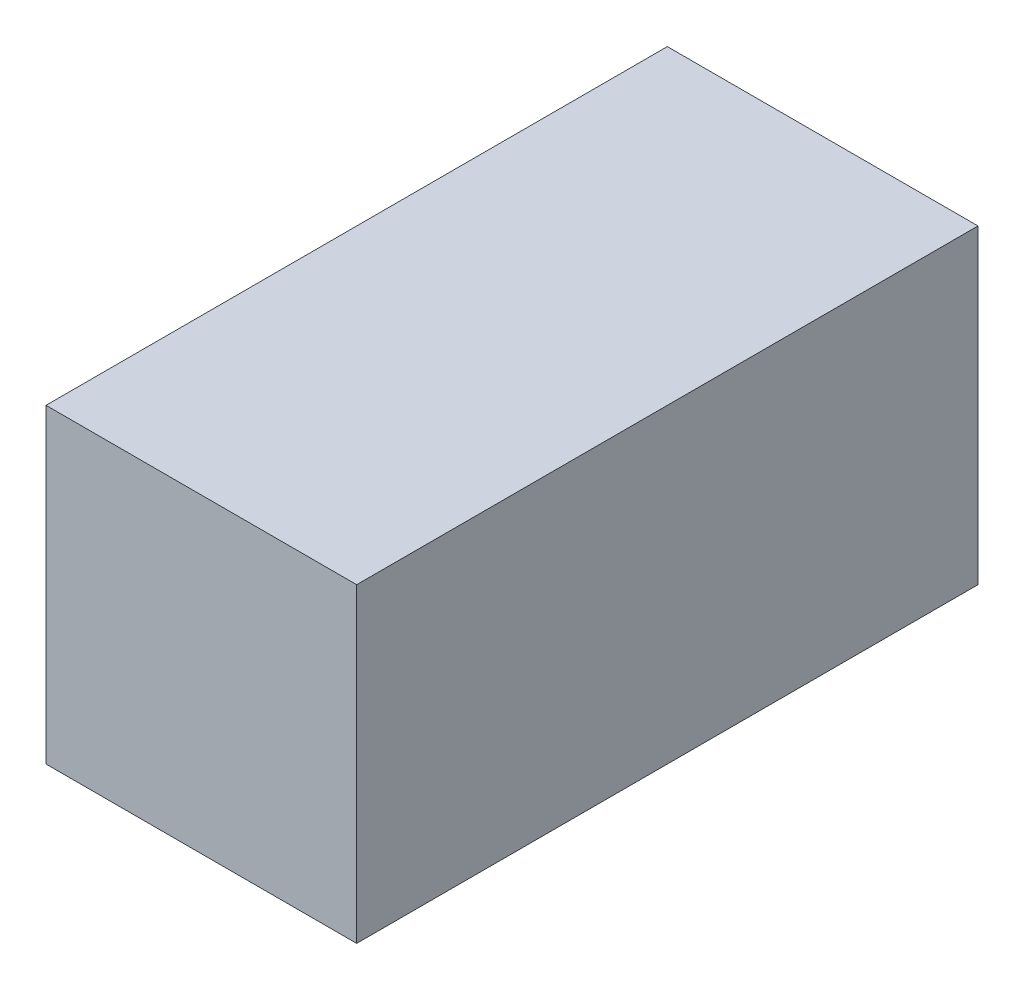
ISO-10303-21;
HEADER;
FILE_DESCRIPTION(('STEP AP214'),'2;1');
FILE_NAME('part.step','',(''),(''),'','','');
FILE_SCHEMA(('AUTOMOTIVE_DESIGN { 1 0 10303 214 1 1 1 1 }'));
ENDSEC;
DATA;
#1=APPLICATION_CONTEXT('core data for automotive mechanical design processes');
#2=APPLICATION_PROTOCOL_DEFINITION('international standard','automotive_design',2000,#1);
#3=PRODUCT_CONTEXT('',#1,'mechanical');
#4=PRODUCT('Part','Part','',(#3));
#5=PRODUCT_RELATED_PRODUCT_CATEGORY('part','',(#4));
#6=PRODUCT_DEFINITION_FORMATION('','',#4);
#7=PRODUCT_DEFINITION_CONTEXT('part definition',#1,'design');
#8=PRODUCT_DEFINITION('design','',#6,#7);
#9=PRODUCT_DEFINITION_SHAPE('','',#8);
#10=(LENGTH_UNIT() NAMED_UNIT(*) SI_UNIT(.MILLI.,.METRE.));
#11=(NAMED_UNIT(*) PLANE_ANGLE_UNIT() SI_UNIT($,.RADIAN.));
#12=(NAMED_UNIT(*) SI_UNIT($,.STERADIAN.) SOLID_ANGLE_UNIT());
#13=UNCERTAINTY_MEASURE_WITH_UNIT(LENGTH_MEASURE(1.E-05),#10,'distance_accuracy_value','');
#14=(GEOMETRIC_REPRESENTATION_CONTEXT(3) GLOBAL_UNCERTAINTY_ASSIGNED_CONTEXT((#13)) GLOBAL_UNIT_ASSIGNED_CONTEXT((#10,
#11,#12)) REPRESENTATION_CONTEXT('',''));
#15=CARTESIAN_POINT('',(0.,0.,0.));
#16=DIRECTION('',(0.,0.,1.));
#17=DIRECTION('',(1.,0.,0.));
#18=AXIS2_PLACEMENT_3D('',#15,#16,#17);
#19=CARTESIAN_POINT('',(-0.126999999999836,0.253999999999949,0.254000000000004));
#20=DIRECTION('',(1.,0.,0.));
#21=DIRECTION('',(0.,1.,0.));
#22=AXIS2_PLACEMENT_3D('',#19,#20,#21);
#23=PLANE('',#22);
#24=DIRECTION('',(0.,-1.,0.));
#25=VECTOR('',#24,1.);
#26=CARTESIAN_POINT('',(-0.126999999999836,0.253999999999949,-0.253999999999949));
#27=LINE('',#26,#25);
#28=CARTESIAN_POINT('',(-0.126999999999836,0.253999999999949,-0.253999999999949));
#29=VERTEX_POINT('',#28);
#30=CARTESIAN_POINT('',(-0.126999999999787,0.,-0.253999999999949));
#31=VERTEX_POINT('',#30);
#32=EDGE_CURVE('E97',#29,#31,#27,.T.);
#33=ORIENTED_EDGE('',*,*,#32,.T.);
#34=DIRECTION('',(0.,0.,-0.999999999999933));
#35=VECTOR('',#34,1.);
#36=CARTESIAN_POINT('',(-0.126999999999761,0.,0.254000000000004));
#37=LINE('',#36,#35);
#38=CARTESIAN_POINT('',(-0.126999999999761,0.,0.254000000000004));
#39=VERTEX_POINT('',#38);
#40=EDGE_CURVE('E11',#39,#31,#37,.T.);
#41=ORIENTED_EDGE('',*,*,#40,.F.);
#42=DIRECTION('',(0.,-1.,0.));
#43=VECTOR('',#42,1.);
#44=CARTESIAN_POINT('',(-0.126999999999836,0.253999999999949,0.254000000000004));
#45=LINE('',#44,#43);
#46=CARTESIAN_POINT('',(-0.126999999999836,0.253999999999949,0.254000000000004));
#47=VERTEX_POINT('',#46);
#48=EDGE_CURVE('E85',#47,#39,#45,.T.);
#49=ORIENTED_EDGE('',*,*,#48,.F.);
#50=DIRECTION('',(0.,0.,-0.999999999999933));
#51=VECTOR('',#50,1.);
#52=CARTESIAN_POINT('',(-0.126999999999836,0.253999999999949,0.254000000000004));
#53=LINE('',#52,#51);
#54=EDGE_CURVE('E93',#47,#29,#53,.T.);
#55=ORIENTED_EDGE('',*,*,#54,.T.);
#56=EDGE_LOOP('',(#33,#41,#49,#55));
#57=FACE_BOUND('',#56,.T.);
#58=ADVANCED_FACE('F34',(#57),#23,.F.);
#59=CARTESIAN_POINT('',(-0.126999999999761,0.,0.254000000000004));
#60=DIRECTION('',(0.,1.00000000000001,0.));
#61=DIRECTION('',(0.,0.,0.999999999999933));
#62=AXIS2_PLACEMENT_3D('',#59,#60,#61);
#63=PLANE('',#62);
#64=DIRECTION('',(1.00000000000001,0.,0.));
#65=VECTOR('',#64,1.);
#66=CARTESIAN_POINT('',(-0.126999999999787,0.,-0.253999999999949));
#67=LINE('',#66,#65);
#68=CARTESIAN_POINT('',(0.127000000000151,0.,-0.253999999999865));
#69=VERTEX_POINT('',#68);
#70=EDGE_CURVE('E89',#31,#69,#67,.T.);
#71=ORIENTED_EDGE('',*,*,#70,.T.);
#72=DIRECTION('',(0.,0.,-0.999999999999933));
#73=VECTOR('',#72,1.);
#74=CARTESIAN_POINT('',(0.12700000000008,0.,0.254000000000004));
#75=LINE('',#74,#73);
#76=CARTESIAN_POINT('',(0.12700000000008,0.,0.254000000000004));
#77=VERTEX_POINT('',#76);
#78=EDGE_CURVE('E42',#77,#69,#75,.T.);
#79=ORIENTED_EDGE('',*,*,#78,.F.);
#80=DIRECTION('',(1.00000000000001,0.,0.));
#81=VECTOR('',#80,1.);
#82=CARTESIAN_POINT('',(-0.126999999999761,0.,0.254000000000004));
#83=LINE('',#82,#81);
#84=EDGE_CURVE('E80',#39,#77,#83,.T.);
#85=ORIENTED_EDGE('',*,*,#84,.F.);
#86=ORIENTED_EDGE('',*,*,#40,.T.);
#87=EDGE_LOOP('',(#71,#79,#85,#86));
#88=FACE_BOUND('',#87,.T.);
#89=ADVANCED_FACE('F88',(#88),#63,.F.);
#90=CARTESIAN_POINT('',(0.127000000000061,0.253999999999935,0.254000000000004));
#91=DIRECTION('',(-1.00000000000001,0.,0.));
#92=DIRECTION('',(0.,-1.00000000000001,0.));
#93=AXIS2_PLACEMENT_3D('',#90,#91,#92);
#94=PLANE('',#93);
#95=DIRECTION('',(0.,1.00000000000001,0.));
#96=VECTOR('',#95,1.);
#97=CARTESIAN_POINT('',(0.127000000000214,0.253999999999976,-0.253999999999865));
#98=LINE('',#97,#96);
#99=CARTESIAN_POINT('',(0.127000000000214,0.253999999999976,-0.253999999999865));
#100=VERTEX_POINT('',#99);
#101=EDGE_CURVE('E67',#69,#100,#98,.T.);
#102=ORIENTED_EDGE('',*,*,#101,.T.);
#103=DIRECTION('',(0.,0.,-0.999999999999933));
#104=VECTOR('',#103,1.);
#105=CARTESIAN_POINT('',(0.127000000000061,0.253999999999935,0.254000000000004));
#106=LINE('',#105,#104);
#107=CARTESIAN_POINT('',(0.127000000000061,0.253999999999935,0.254000000000004));
#108=VERTEX_POINT('',#107);
#109=EDGE_CURVE('E90',#108,#100,#106,.T.);
#110=ORIENTED_EDGE('',*,*,#109,.F.);
#111=DIRECTION('',(0.,1.00000000000001,0.));
#112=VECTOR('',#111,1.);
#113=CARTESIAN_POINT('',(0.127000000000061,0.253999999999935,0.254000000000004));
#114=LINE('',#113,#112);
#115=EDGE_CURVE('E83',#77,#108,#114,.T.);
#116=ORIENTED_EDGE('',*,*,#115,.F.);
#117=ORIENTED_EDGE('',*,*,#78,.T.);
#118=EDGE_LOOP('',(#102,#110,#116,#117));
#119=FACE_BOUND('',#118,.T.);
#120=ADVANCED_FACE('F91',(#119),#94,.F.);
#121=CARTESIAN_POINT('',(-0.126999999999836,0.253999999999949,0.254000000000004));
#122=DIRECTION('',(0.,-1.00000000000001,0.));
#123=DIRECTION('',(0.,0.,-0.999999999999933));
#124=AXIS2_PLACEMENT_3D('',#121,#122,#123);
#125=PLANE('',#124);
#126=DIRECTION('',(-1.00000000000001,0.,0.));
#127=VECTOR('',#126,1.);
#128=CARTESIAN_POINT('',(-0.126999999999836,0.253999999999949,-0.253999999999949));
#129=LINE('',#128,#127);
#130=EDGE_CURVE('E73',#100,#29,#129,.T.);
#131=ORIENTED_EDGE('',*,*,#130,.T.);
#132=ORIENTED_EDGE('',*,*,#54,.F.);
#133=DIRECTION('',(-1.00000000000001,0.,0.));
#134=VECTOR('',#133,1.);
#135=CARTESIAN_POINT('',(-0.126999999999836,0.253999999999949,0.254000000000004));
#136=LINE('',#135,#134);
#137=EDGE_CURVE('E50',#108,#47,#136,.T.);
#138=ORIENTED_EDGE('',*,*,#137,.F.);
#139=ORIENTED_EDGE('',*,*,#109,.T.);
#140=EDGE_LOOP('',(#131,#132,#138,#139));
#141=FACE_BOUND('',#140,.T.);
#142=ADVANCED_FACE('F104',(#141),#125,.F.);
#143=CARTESIAN_POINT('',(-0.126999999999761,0.,0.254000000000004));
#144=DIRECTION('',(0.,0.,0.999999999999933));
#145=DIRECTION('',(1.00000000000001,0.,0.));
#146=AXIS2_PLACEMENT_3D('',#143,#144,#145);
#147=PLANE('',#146);
#148=ORIENTED_EDGE('',*,*,#48,.T.);
#149=ORIENTED_EDGE('',*,*,#84,.T.);
#150=ORIENTED_EDGE('',*,*,#115,.T.);
#151=ORIENTED_EDGE('',*,*,#137,.T.);
#152=EDGE_LOOP('',(#148,#149,#150,#151));
#153=FACE_BOUND('',#152,.T.);
#154=ADVANCED_FACE('F81',(#153),#147,.T.);
#155=CARTESIAN_POINT('',(-0.126999999999787,0.,-0.253999999999949));
#156=DIRECTION('',(0.,0.,0.999999999999933));
#157=DIRECTION('',(1.00000000000001,0.,0.));
#158=AXIS2_PLACEMENT_3D('',#155,#156,#157);
#159=PLANE('',#158);
#160=ORIENTED_EDGE('',*,*,#32,.F.);
#161=ORIENTED_EDGE('',*,*,#130,.F.);
#162=ORIENTED_EDGE('',*,*,#101,.F.);
#163=ORIENTED_EDGE('',*,*,#70,.F.);
#164=EDGE_LOOP('',(#160,#161,#162,#163));
#165=FACE_BOUND('',#164,.T.);
#166=ADVANCED_FACE('F107',(#165),#159,.F.);
#167=CLOSED_SHELL('',(#58,#89,#120,#142,#154,#166));
#168=MANIFOLD_SOLID_BREP('B2',#167);
#169=ADVANCED_BREP_SHAPE_REPRESENTATION('',(#18,#168),#14);
#170=SHAPE_DEFINITION_REPRESENTATION(#9,#169);
ENDSEC;
END-ISO-10303-21;
